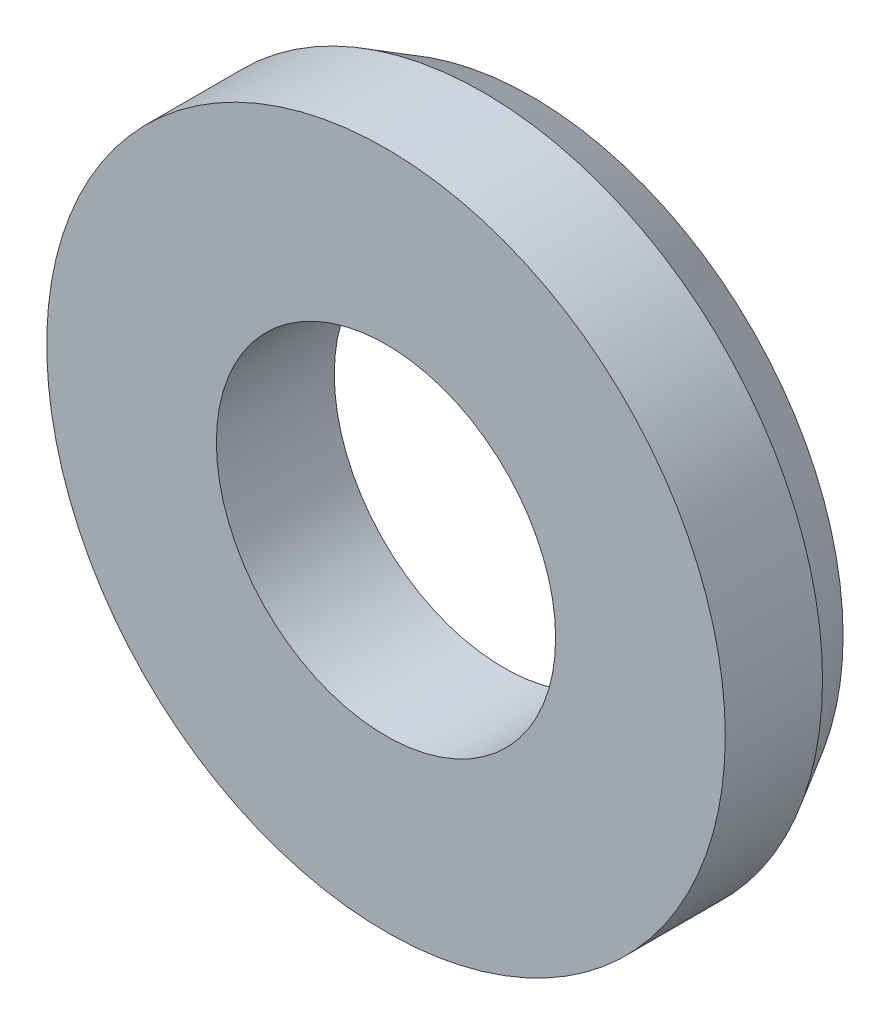
ISO-10303-21;
HEADER;
FILE_DESCRIPTION(('STEP AP214'),'2;1');
FILE_NAME('part.step','',(''),(''),'','','');
FILE_SCHEMA(('AUTOMOTIVE_DESIGN { 1 0 10303 214 1 1 1 1 }'));
ENDSEC;
DATA;
#1=APPLICATION_CONTEXT('core data for automotive mechanical design processes');
#2=APPLICATION_PROTOCOL_DEFINITION('international standard','automotive_design',2000,#1);
#3=PRODUCT_CONTEXT('',#1,'mechanical');
#4=PRODUCT('Part','Part','',(#3));
#5=PRODUCT_RELATED_PRODUCT_CATEGORY('part','',(#4));
#6=PRODUCT_DEFINITION_FORMATION('','',#4);
#7=PRODUCT_DEFINITION_CONTEXT('part definition',#1,'design');
#8=PRODUCT_DEFINITION('design','',#6,#7);
#9=PRODUCT_DEFINITION_SHAPE('','',#8);
#10=(LENGTH_UNIT() NAMED_UNIT(*) SI_UNIT(.MILLI.,.METRE.));
#11=(NAMED_UNIT(*) PLANE_ANGLE_UNIT() SI_UNIT($,.RADIAN.));
#12=(NAMED_UNIT(*) SI_UNIT($,.STERADIAN.) SOLID_ANGLE_UNIT());
#13=UNCERTAINTY_MEASURE_WITH_UNIT(LENGTH_MEASURE(1.E-05),#10,'distance_accuracy_value','');
#14=(GEOMETRIC_REPRESENTATION_CONTEXT(3) GLOBAL_UNCERTAINTY_ASSIGNED_CONTEXT((#13)) GLOBAL_UNIT_ASSIGNED_CONTEXT((#10,
#11,#12)) REPRESENTATION_CONTEXT('',''));
#15=CARTESIAN_POINT('',(0.,0.,0.));
#16=DIRECTION('',(0.,0.,1.));
#17=DIRECTION('',(1.,0.,0.));
#18=AXIS2_PLACEMENT_3D('',#15,#16,#17);
#19=CARTESIAN_POINT('',(0.,0.,-1.00666666666667));
#20=DIRECTION('',(0.,0.,1.));
#21=DIRECTION('',(1.,0.,0.));
#22=AXIS2_PLACEMENT_3D('',#19,#20,#21);
#23=CONICAL_SURFACE('',#22,1.,0.5235987755983);
#24=CARTESIAN_POINT('',(0.,0.,-1.15));
#25=DIRECTION('',(0.,0.,1.));
#26=DIRECTION('',(1.,0.,0.));
#27=AXIS2_PLACEMENT_3D('',#24,#25,#26);
#28=CIRCLE('',#27,0.917246461416154);
#29=CARTESIAN_POINT('',(0.917246461416154,0.,-1.15));
#30=VERTEX_POINT('',#29);
#31=EDGE_CURVE('E52',#30,#30,#28,.T.);
#32=ORIENTED_EDGE('',*,*,#31,.T.);
#33=EDGE_LOOP('',(#32));
#34=FACE_BOUND('',#33,.T.);
#35=CARTESIAN_POINT('',(0.,0.,-1.00666666666667));
#36=DIRECTION('',(0.,0.,1.));
#37=DIRECTION('',(1.,0.,0.));
#38=AXIS2_PLACEMENT_3D('',#35,#36,#37);
#39=CIRCLE('',#38,1.);
#40=CARTESIAN_POINT('',(1.,0.,-1.00666666666667));
#41=VERTEX_POINT('',#40);
#42=EDGE_CURVE('E10',#41,#41,#39,.T.);
#43=ORIENTED_EDGE('',*,*,#42,.F.);
#44=EDGE_LOOP('',(#43));
#45=FACE_BOUND('',#44,.T.);
#46=ADVANCED_FACE('F30',(#34,#45),#23,.T.);
#47=CARTESIAN_POINT('',(0.,0.,-1.15));
#48=DIRECTION('',(0.,0.,1.));
#49=DIRECTION('',(1.,0.,0.));
#50=AXIS2_PLACEMENT_3D('',#47,#48,#49);
#51=CYLINDRICAL_SURFACE('',#50,1.);
#52=ORIENTED_EDGE('',*,*,#42,.T.);
#53=EDGE_LOOP('',(#52));
#54=FACE_BOUND('',#53,.T.);
#55=CARTESIAN_POINT('',(0.,0.,-0.72));
#56=DIRECTION('',(0.,0.,1.));
#57=DIRECTION('',(1.,0.,0.));
#58=AXIS2_PLACEMENT_3D('',#55,#56,#57);
#59=CIRCLE('',#58,1.);
#60=CARTESIAN_POINT('',(1.,0.,-0.72));
#61=VERTEX_POINT('',#60);
#62=EDGE_CURVE('E36',#61,#61,#59,.T.);
#63=ORIENTED_EDGE('',*,*,#62,.F.);
#64=EDGE_LOOP('',(#63));
#65=FACE_BOUND('',#64,.T.);
#66=ADVANCED_FACE('F70',(#54,#65),#51,.T.);
#67=CARTESIAN_POINT('',(0.5,0.,-0.72));
#68=DIRECTION('',(0.,0.,1.));
#69=DIRECTION('',(1.,0.,0.));
#70=AXIS2_PLACEMENT_3D('',#67,#68,#69);
#71=PLANE('',#70);
#72=ORIENTED_EDGE('',*,*,#62,.T.);
#73=EDGE_LOOP('',(#72));
#74=FACE_BOUND('',#73,.T.);
#75=CARTESIAN_POINT('',(0.,0.,-0.72));
#76=DIRECTION('',(0.,0.,1.));
#77=DIRECTION('',(1.,0.,0.));
#78=AXIS2_PLACEMENT_3D('',#75,#76,#77);
#79=CIRCLE('',#78,0.5);
#80=CARTESIAN_POINT('',(0.5,0.,-0.72));
#81=VERTEX_POINT('',#80);
#82=EDGE_CURVE('E40',#81,#81,#79,.T.);
#83=ORIENTED_EDGE('',*,*,#82,.F.);
#84=EDGE_LOOP('',(#83));
#85=FACE_BOUND('',#84,.T.);
#86=ADVANCED_FACE('F74',(#74,#85),#71,.T.);
#87=CARTESIAN_POINT('',(0.,0.,-1.15));
#88=DIRECTION('',(0.,0.,1.));
#89=DIRECTION('',(1.,0.,0.));
#90=AXIS2_PLACEMENT_3D('',#87,#88,#89);
#91=CYLINDRICAL_SURFACE('',#90,0.5);
#92=ORIENTED_EDGE('',*,*,#82,.T.);
#93=EDGE_LOOP('',(#92));
#94=FACE_BOUND('',#93,.T.);
#95=CARTESIAN_POINT('',(0.,0.,-1.06755794867021));
#96=DIRECTION('',(0.,0.,1.));
#97=DIRECTION('',(1.,0.,0.));
#98=AXIS2_PLACEMENT_3D('',#95,#96,#97);
#99=CIRCLE('',#98,0.5);
#100=CARTESIAN_POINT('',(0.5,0.,-1.06755794867021));
#101=VERTEX_POINT('',#100);
#102=EDGE_CURVE('E44',#101,#101,#99,.T.);
#103=ORIENTED_EDGE('',*,*,#102,.F.);
#104=EDGE_LOOP('',(#103));
#105=FACE_BOUND('',#104,.T.);
#106=ADVANCED_FACE('F66',(#94,#105),#91,.F.);
#107=CARTESIAN_POINT('',(0.,0.,-3.00404962177392));
#108=DIRECTION('',(0.,0.,1.));
#109=DIRECTION('',(1.,0.,0.));
#110=AXIS2_PLACEMENT_3D('',#107,#108,#109);
#111=SPHERICAL_SURFACE('',#110,2.);
#112=ORIENTED_EDGE('',*,*,#102,.T.);
#113=EDGE_LOOP('',(#112));
#114=FACE_BOUND('',#113,.T.);
#115=CARTESIAN_POINT('',(0.,0.,-1.15));
#116=DIRECTION('',(0.,0.,1.));
#117=DIRECTION('',(1.,0.,0.));
#118=AXIS2_PLACEMENT_3D('',#115,#116,#117);
#119=CIRCLE('',#118,0.75);
#120=CARTESIAN_POINT('',(0.75,0.,-1.15));
#121=VERTEX_POINT('',#120);
#122=EDGE_CURVE('E49',#121,#121,#119,.T.);
#123=ORIENTED_EDGE('',*,*,#122,.F.);
#124=EDGE_LOOP('',(#123));
#125=FACE_BOUND('',#124,.T.);
#126=ADVANCED_FACE('F60',(#114,#125),#111,.F.);
#127=CARTESIAN_POINT('',(0.917246461416154,0.,-1.15));
#128=DIRECTION('',(0.,0.,-1.));
#129=DIRECTION('',(-1.,0.,0.));
#130=AXIS2_PLACEMENT_3D('',#127,#128,#129);
#131=PLANE('',#130);
#132=ORIENTED_EDGE('',*,*,#122,.T.);
#133=EDGE_LOOP('',(#132));
#134=FACE_BOUND('',#133,.T.);
#135=ORIENTED_EDGE('',*,*,#31,.F.);
#136=EDGE_LOOP('',(#135));
#137=FACE_BOUND('',#136,.T.);
#138=ADVANCED_FACE('F58',(#134,#137),#131,.T.);
#139=CLOSED_SHELL('',(#46,#66,#86,#106,#126,#138));
#140=MANIFOLD_SOLID_BREP('B2',#139);
#141=ADVANCED_BREP_SHAPE_REPRESENTATION('',(#18,#140),#14);
#142=SHAPE_DEFINITION_REPRESENTATION(#9,#141);
ENDSEC;
END-ISO-10303-21;
